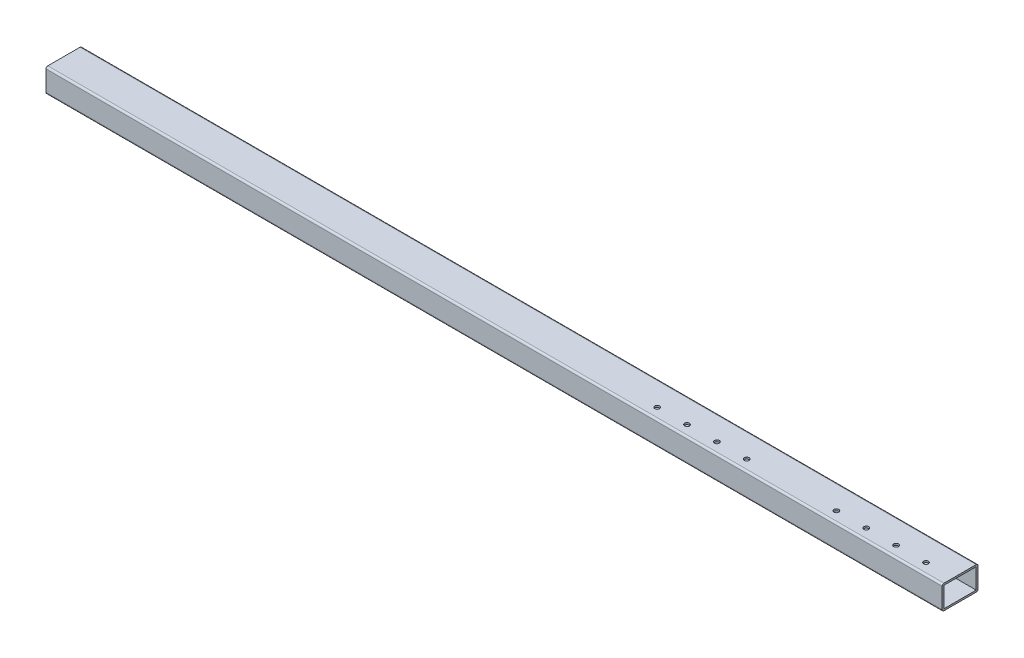
ISO-10303-21;
HEADER;
FILE_DESCRIPTION(('STEP AP214'),'2;1');
FILE_NAME('part.step','',(''),(''),'','','');
FILE_SCHEMA(('AUTOMOTIVE_DESIGN { 1 0 10303 214 1 1 1 1 }'));
ENDSEC;
DATA;
#1=APPLICATION_CONTEXT('core data for automotive mechanical design processes');
#2=APPLICATION_PROTOCOL_DEFINITION('international standard','automotive_design',2000,#1);
#3=PRODUCT_CONTEXT('',#1,'mechanical');
#4=PRODUCT('Part','Part','',(#3));
#5=PRODUCT_RELATED_PRODUCT_CATEGORY('part','',(#4));
#6=PRODUCT_DEFINITION_FORMATION('','',#4);
#7=PRODUCT_DEFINITION_CONTEXT('part definition',#1,'design');
#8=PRODUCT_DEFINITION('design','',#6,#7);
#9=PRODUCT_DEFINITION_SHAPE('','',#8);
#10=(LENGTH_UNIT() NAMED_UNIT(*) SI_UNIT(.MILLI.,.METRE.));
#11=(NAMED_UNIT(*) PLANE_ANGLE_UNIT() SI_UNIT($,.RADIAN.));
#12=(NAMED_UNIT(*) SI_UNIT($,.STERADIAN.) SOLID_ANGLE_UNIT());
#13=UNCERTAINTY_MEASURE_WITH_UNIT(LENGTH_MEASURE(1.E-05),#10,'distance_accuracy_value','');
#14=(GEOMETRIC_REPRESENTATION_CONTEXT(3) GLOBAL_UNCERTAINTY_ASSIGNED_CONTEXT((#13)) GLOBAL_UNIT_ASSIGNED_CONTEXT((#10,
#11,#12)) REPRESENTATION_CONTEXT('',''));
#15=CARTESIAN_POINT('',(0.,0.,0.));
#16=DIRECTION('',(0.,0.,1.));
#17=DIRECTION('',(1.,0.,0.));
#18=AXIS2_PLACEMENT_3D('',#15,#16,#17);
#19=CARTESIAN_POINT('',(1500.,17.,27.));
#20=DIRECTION('',(1.,0.,0.));
#21=DIRECTION('',(0.,0.,-1.));
#22=AXIS2_PLACEMENT_3D('',#19,#20,#21);
#23=PLANE('',#22);
#24=CARTESIAN_POINT('',(1500.,17.,27.));
#25=DIRECTION('',(1.,0.,0.));
#26=DIRECTION('',(0.,0.,-1.));
#27=AXIS2_PLACEMENT_3D('',#24,#25,#26);
#28=CIRCLE('',#27,2.99999999999999);
#29=CARTESIAN_POINT('',(1500.,20.,27.));
#30=VERTEX_POINT('',#29);
#31=CARTESIAN_POINT('',(1500.,17.,30.));
#32=VERTEX_POINT('',#31);
#33=EDGE_CURVE('E199',#30,#32,#28,.T.);
#34=ORIENTED_EDGE('',*,*,#33,.T.);
#35=DIRECTION('',(0.,-1.,0.));
#36=VECTOR('',#35,1.);
#37=CARTESIAN_POINT('',(1500.,17.,30.));
#38=LINE('',#37,#36);
#39=CARTESIAN_POINT('',(1500.,-17.,30.));
#40=VERTEX_POINT('',#39);
#41=EDGE_CURVE('E202',#32,#40,#38,.T.);
#42=ORIENTED_EDGE('',*,*,#41,.T.);
#43=CARTESIAN_POINT('',(1500.,-17.,27.));
#44=DIRECTION('',(1.,0.,0.));
#45=DIRECTION('',(0.,0.,-1.));
#46=AXIS2_PLACEMENT_3D('',#43,#44,#45);
#47=CIRCLE('',#46,3.);
#48=CARTESIAN_POINT('',(1500.,-20.,27.));
#49=VERTEX_POINT('',#48);
#50=EDGE_CURVE('E205',#40,#49,#47,.T.);
#51=ORIENTED_EDGE('',*,*,#50,.T.);
#52=DIRECTION('',(0.,0.,-1.));
#53=VECTOR('',#52,1.);
#54=CARTESIAN_POINT('',(1500.,-20.,27.));
#55=LINE('',#54,#53);
#56=CARTESIAN_POINT('',(1500.,-20.,-27.));
#57=VERTEX_POINT('',#56);
#58=EDGE_CURVE('E207',#49,#57,#55,.T.);
#59=ORIENTED_EDGE('',*,*,#58,.T.);
#60=CARTESIAN_POINT('',(1500.,-17.,-27.));
#61=DIRECTION('',(1.,0.,0.));
#62=DIRECTION('',(0.,0.,-1.));
#63=AXIS2_PLACEMENT_3D('',#60,#61,#62);
#64=CIRCLE('',#63,3.);
#65=CARTESIAN_POINT('',(1500.,-17.,-30.));
#66=VERTEX_POINT('',#65);
#67=EDGE_CURVE('E209',#57,#66,#64,.T.);
#68=ORIENTED_EDGE('',*,*,#67,.T.);
#69=DIRECTION('',(0.,1.,0.));
#70=VECTOR('',#69,1.);
#71=CARTESIAN_POINT('',(1500.,17.,-30.));
#72=LINE('',#71,#70);
#73=CARTESIAN_POINT('',(1500.,17.,-30.));
#74=VERTEX_POINT('',#73);
#75=EDGE_CURVE('E211',#66,#74,#72,.T.);
#76=ORIENTED_EDGE('',*,*,#75,.T.);
#77=CARTESIAN_POINT('',(1500.,17.,-27.));
#78=DIRECTION('',(1.,0.,0.));
#79=DIRECTION('',(0.,0.,1.));
#80=AXIS2_PLACEMENT_3D('',#77,#78,#79);
#81=CIRCLE('',#80,3.);
#82=CARTESIAN_POINT('',(1500.,20.,-27.));
#83=VERTEX_POINT('',#82);
#84=EDGE_CURVE('E213',#74,#83,#81,.T.);
#85=ORIENTED_EDGE('',*,*,#84,.T.);
#86=DIRECTION('',(0.,0.,1.));
#87=VECTOR('',#86,1.);
#88=CARTESIAN_POINT('',(1500.,20.,27.));
#89=LINE('',#88,#87);
#90=EDGE_CURVE('E215',#83,#30,#89,.T.);
#91=ORIENTED_EDGE('',*,*,#90,.T.);
#92=EDGE_LOOP('',(#34,#42,#51,#59,#68,#76,#85,#91));
#93=FACE_BOUND('',#92,.T.);
#94=DIRECTION('',(0.,0.,-1.));
#95=VECTOR('',#94,1.);
#96=CARTESIAN_POINT('',(1500.,-17.,27.));
#97=LINE('',#96,#95);
#98=CARTESIAN_POINT('',(1500.,-17.,27.));
#99=VERTEX_POINT('',#98);
#100=CARTESIAN_POINT('',(1500.,-17.,-27.));
#101=VERTEX_POINT('',#100);
#102=EDGE_CURVE('E169',#99,#101,#97,.T.);
#103=ORIENTED_EDGE('',*,*,#102,.F.);
#104=DIRECTION('',(0.,-1.,0.));
#105=VECTOR('',#104,1.);
#106=CARTESIAN_POINT('',(1500.,17.,27.));
#107=LINE('',#106,#105);
#108=CARTESIAN_POINT('',(1500.,17.,27.));
#109=VERTEX_POINT('',#108);
#110=EDGE_CURVE('E161',#109,#99,#107,.T.);
#111=ORIENTED_EDGE('',*,*,#110,.F.);
#112=DIRECTION('',(0.,0.,1.));
#113=VECTOR('',#112,1.);
#114=CARTESIAN_POINT('',(1500.,17.,27.));
#115=LINE('',#114,#113);
#116=CARTESIAN_POINT('',(1500.,17.,-27.));
#117=VERTEX_POINT('',#116);
#118=EDGE_CURVE('E183',#117,#109,#115,.T.);
#119=ORIENTED_EDGE('',*,*,#118,.F.);
#120=DIRECTION('',(0.,1.,0.));
#121=VECTOR('',#120,1.);
#122=CARTESIAN_POINT('',(1500.,17.,-27.));
#123=LINE('',#122,#121);
#124=EDGE_CURVE('E181',#101,#117,#123,.T.);
#125=ORIENTED_EDGE('',*,*,#124,.F.);
#126=EDGE_LOOP('',(#103,#111,#119,#125));
#127=FACE_BOUND('',#126,.T.);
#128=ADVANCED_FACE('F70',(#93,#127),#23,.T.);
#129=CARTESIAN_POINT('',(0.,17.,27.));
#130=DIRECTION('',(1.,0.,0.));
#131=DIRECTION('',(0.,0.,-1.));
#132=AXIS2_PLACEMENT_3D('',#129,#130,#131);
#133=PLANE('',#132);
#134=CARTESIAN_POINT('',(0.,17.,27.));
#135=DIRECTION('',(1.,0.,0.));
#136=DIRECTION('',(0.,0.,-1.));
#137=AXIS2_PLACEMENT_3D('',#134,#135,#136);
#138=CIRCLE('',#137,2.99999999999999);
#139=CARTESIAN_POINT('',(0.,20.,27.));
#140=VERTEX_POINT('',#139);
#141=CARTESIAN_POINT('',(0.,17.,30.));
#142=VERTEX_POINT('',#141);
#143=EDGE_CURVE('E177',#140,#142,#138,.T.);
#144=ORIENTED_EDGE('',*,*,#143,.F.);
#145=DIRECTION('',(0.,0.,1.));
#146=VECTOR('',#145,1.);
#147=CARTESIAN_POINT('',(0.,20.,27.));
#148=LINE('',#147,#146);
#149=CARTESIAN_POINT('',(0.,20.,-27.));
#150=VERTEX_POINT('',#149);
#151=EDGE_CURVE('E203',#150,#140,#148,.T.);
#152=ORIENTED_EDGE('',*,*,#151,.F.);
#153=CARTESIAN_POINT('',(0.,17.,-27.));
#154=DIRECTION('',(1.,0.,0.));
#155=DIRECTION('',(0.,0.,1.));
#156=AXIS2_PLACEMENT_3D('',#153,#154,#155);
#157=CIRCLE('',#156,3.);
#158=CARTESIAN_POINT('',(0.,17.,-30.));
#159=VERTEX_POINT('',#158);
#160=EDGE_CURVE('E230',#159,#150,#157,.T.);
#161=ORIENTED_EDGE('',*,*,#160,.F.);
#162=DIRECTION('',(0.,1.,0.));
#163=VECTOR('',#162,1.);
#164=CARTESIAN_POINT('',(0.,17.,-30.));
#165=LINE('',#164,#163);
#166=CARTESIAN_POINT('',(0.,-17.,-30.));
#167=VERTEX_POINT('',#166);
#168=EDGE_CURVE('E228',#167,#159,#165,.T.);
#169=ORIENTED_EDGE('',*,*,#168,.F.);
#170=CARTESIAN_POINT('',(0.,-17.,-27.));
#171=DIRECTION('',(1.,0.,0.));
#172=DIRECTION('',(0.,0.,-1.));
#173=AXIS2_PLACEMENT_3D('',#170,#171,#172);
#174=CIRCLE('',#173,3.);
#175=CARTESIAN_POINT('',(0.,-20.,-27.));
#176=VERTEX_POINT('',#175);
#177=EDGE_CURVE('E226',#176,#167,#174,.T.);
#178=ORIENTED_EDGE('',*,*,#177,.F.);
#179=DIRECTION('',(0.,0.,-1.));
#180=VECTOR('',#179,1.);
#181=CARTESIAN_POINT('',(0.,-20.,27.));
#182=LINE('',#181,#180);
#183=CARTESIAN_POINT('',(0.,-20.,27.));
#184=VERTEX_POINT('',#183);
#185=EDGE_CURVE('E224',#184,#176,#182,.T.);
#186=ORIENTED_EDGE('',*,*,#185,.F.);
#187=CARTESIAN_POINT('',(0.,-17.,27.));
#188=DIRECTION('',(1.,0.,0.));
#189=DIRECTION('',(0.,0.,-1.));
#190=AXIS2_PLACEMENT_3D('',#187,#188,#189);
#191=CIRCLE('',#190,3.);
#192=CARTESIAN_POINT('',(0.,-17.,30.));
#193=VERTEX_POINT('',#192);
#194=EDGE_CURVE('E222',#193,#184,#191,.T.);
#195=ORIENTED_EDGE('',*,*,#194,.F.);
#196=DIRECTION('',(0.,-1.,0.));
#197=VECTOR('',#196,1.);
#198=CARTESIAN_POINT('',(0.,17.,30.));
#199=LINE('',#198,#197);
#200=EDGE_CURVE('E220',#142,#193,#199,.T.);
#201=ORIENTED_EDGE('',*,*,#200,.F.);
#202=EDGE_LOOP('',(#144,#152,#161,#169,#178,#186,#195,#201));
#203=FACE_BOUND('',#202,.T.);
#204=DIRECTION('',(0.,-1.,0.));
#205=VECTOR('',#204,1.);
#206=CARTESIAN_POINT('',(0.,17.,27.));
#207=LINE('',#206,#205);
#208=CARTESIAN_POINT('',(0.,17.,27.));
#209=VERTEX_POINT('',#208);
#210=CARTESIAN_POINT('',(0.,-17.,27.));
#211=VERTEX_POINT('',#210);
#212=EDGE_CURVE('E95',#209,#211,#207,.T.);
#213=ORIENTED_EDGE('',*,*,#212,.T.);
#214=DIRECTION('',(0.,0.,-1.));
#215=VECTOR('',#214,1.);
#216=CARTESIAN_POINT('',(0.,-17.,27.));
#217=LINE('',#216,#215);
#218=CARTESIAN_POINT('',(0.,-17.,-27.));
#219=VERTEX_POINT('',#218);
#220=EDGE_CURVE('E176',#211,#219,#217,.T.);
#221=ORIENTED_EDGE('',*,*,#220,.T.);
#222=DIRECTION('',(0.,1.,0.));
#223=VECTOR('',#222,1.);
#224=CARTESIAN_POINT('',(0.,17.,-27.));
#225=LINE('',#224,#223);
#226=CARTESIAN_POINT('',(0.,17.,-27.));
#227=VERTEX_POINT('',#226);
#228=EDGE_CURVE('E191',#219,#227,#225,.T.);
#229=ORIENTED_EDGE('',*,*,#228,.T.);
#230=DIRECTION('',(0.,0.,1.));
#231=VECTOR('',#230,1.);
#232=CARTESIAN_POINT('',(0.,17.,27.));
#233=LINE('',#232,#231);
#234=EDGE_CURVE('E170',#227,#209,#233,.T.);
#235=ORIENTED_EDGE('',*,*,#234,.T.);
#236=EDGE_LOOP('',(#213,#221,#229,#235));
#237=FACE_BOUND('',#236,.T.);
#238=ADVANCED_FACE('F319',(#203,#237),#133,.F.);
#239=CARTESIAN_POINT('',(1500.,17.,27.));
#240=DIRECTION('',(-1.,0.,0.));
#241=DIRECTION('',(0.,0.,1.));
#242=AXIS2_PLACEMENT_3D('',#239,#240,#241);
#243=CYLINDRICAL_SURFACE('',#242,2.99999999999999);
#244=ORIENTED_EDGE('',*,*,#143,.T.);
#245=DIRECTION('',(-1.,0.,0.));
#246=VECTOR('',#245,1.);
#247=CARTESIAN_POINT('',(1500.,17.,30.));
#248=LINE('',#247,#246);
#249=EDGE_CURVE('E12',#32,#142,#248,.T.);
#250=ORIENTED_EDGE('',*,*,#249,.F.);
#251=ORIENTED_EDGE('',*,*,#33,.F.);
#252=DIRECTION('',(-1.,0.,0.));
#253=VECTOR('',#252,1.);
#254=CARTESIAN_POINT('',(1500.,20.,27.));
#255=LINE('',#254,#253);
#256=EDGE_CURVE('E217',#30,#140,#255,.T.);
#257=ORIENTED_EDGE('',*,*,#256,.T.);
#258=EDGE_LOOP('',(#244,#250,#251,#257));
#259=FACE_BOUND('',#258,.T.);
#260=ADVANCED_FACE('F72',(#259),#243,.T.);
#261=CARTESIAN_POINT('',(1500.,17.,30.));
#262=DIRECTION('',(0.,0.,-1.));
#263=DIRECTION('',(0.,1.,0.));
#264=AXIS2_PLACEMENT_3D('',#261,#262,#263);
#265=PLANE('',#264);
#266=ORIENTED_EDGE('',*,*,#200,.T.);
#267=DIRECTION('',(-1.,0.,0.));
#268=VECTOR('',#267,1.);
#269=CARTESIAN_POINT('',(1500.,-17.,30.));
#270=LINE('',#269,#268);
#271=EDGE_CURVE('E79',#40,#193,#270,.T.);
#272=ORIENTED_EDGE('',*,*,#271,.F.);
#273=ORIENTED_EDGE('',*,*,#41,.F.);
#274=ORIENTED_EDGE('',*,*,#249,.T.);
#275=EDGE_LOOP('',(#266,#272,#273,#274));
#276=FACE_BOUND('',#275,.T.);
#277=ADVANCED_FACE('F349',(#276),#265,.F.);
#278=CARTESIAN_POINT('',(1500.,-17.,27.));
#279=DIRECTION('',(-1.,0.,0.));
#280=DIRECTION('',(0.,0.,1.));
#281=AXIS2_PLACEMENT_3D('',#278,#279,#280);
#282=CYLINDRICAL_SURFACE('',#281,3.);
#283=ORIENTED_EDGE('',*,*,#194,.T.);
#284=DIRECTION('',(-1.,0.,0.));
#285=VECTOR('',#284,1.);
#286=CARTESIAN_POINT('',(1500.,-20.,27.));
#287=LINE('',#286,#285);
#288=EDGE_CURVE('E247',#49,#184,#287,.T.);
#289=ORIENTED_EDGE('',*,*,#288,.F.);
#290=ORIENTED_EDGE('',*,*,#50,.F.);
#291=ORIENTED_EDGE('',*,*,#271,.T.);
#292=EDGE_LOOP('',(#283,#289,#290,#291));
#293=FACE_BOUND('',#292,.T.);
#294=ADVANCED_FACE('F346',(#293),#282,.T.);
#295=CARTESIAN_POINT('',(1500.,-20.,27.));
#296=DIRECTION('',(0.,1.,0.));
#297=DIRECTION('',(0.,0.,1.));
#298=AXIS2_PLACEMENT_3D('',#295,#296,#297);
#299=PLANE('',#298);
#300=CARTESIAN_POINT('',(1405.,-20.,12.0000000000003));
#301=DIRECTION('',(0.,1.,0.));
#302=DIRECTION('',(0.,0.,1.));
#303=AXIS2_PLACEMENT_3D('',#300,#301,#302);
#304=CIRCLE('',#303,4.05000000000013);
#305=CARTESIAN_POINT('',(1405.,-20.,16.0500000000005));
#306=VERTEX_POINT('',#305);
#307=EDGE_CURVE('E260',#306,#306,#304,.T.);
#308=ORIENTED_EDGE('',*,*,#307,.T.);
#309=EDGE_LOOP('',(#308));
#310=FACE_BOUND('',#309,.T.);
#311=CARTESIAN_POINT('',(1355.,-20.,12.0000000000007));
#312=DIRECTION('',(0.,1.,0.));
#313=DIRECTION('',(0.,0.,1.));
#314=AXIS2_PLACEMENT_3D('',#311,#312,#313);
#315=CIRCLE('',#314,4.05000000000013);
#316=CARTESIAN_POINT('',(1355.,-20.,16.0500000000008));
#317=VERTEX_POINT('',#316);
#318=EDGE_CURVE('E446',#317,#317,#315,.T.);
#319=ORIENTED_EDGE('',*,*,#318,.T.);
#320=EDGE_LOOP('',(#319));
#321=FACE_BOUND('',#320,.T.);
#322=CARTESIAN_POINT('',(1305.,-20.,12.000000000001));
#323=DIRECTION('',(0.,1.,0.));
#324=DIRECTION('',(0.,0.,1.));
#325=AXIS2_PLACEMENT_3D('',#322,#323,#324);
#326=CIRCLE('',#325,4.05000000000013);
#327=CARTESIAN_POINT('',(1305.,-20.,16.0500000000012));
#328=VERTEX_POINT('',#327);
#329=EDGE_CURVE('E454',#328,#328,#326,.T.);
#330=ORIENTED_EDGE('',*,*,#329,.T.);
#331=EDGE_LOOP('',(#330));
#332=FACE_BOUND('',#331,.T.);
#333=CARTESIAN_POINT('',(1155.,-20.,12.0000000000021));
#334=DIRECTION('',(0.,1.,0.));
#335=DIRECTION('',(0.,0.,1.));
#336=AXIS2_PLACEMENT_3D('',#333,#334,#335);
#337=CIRCLE('',#336,4.05000000000013);
#338=CARTESIAN_POINT('',(1155.,-20.,16.0500000000022));
#339=VERTEX_POINT('',#338);
#340=EDGE_CURVE('E460',#339,#339,#337,.T.);
#341=ORIENTED_EDGE('',*,*,#340,.T.);
#342=EDGE_LOOP('',(#341));
#343=FACE_BOUND('',#342,.T.);
#344=CARTESIAN_POINT('',(1105.,-20.,12.0000000000024));
#345=DIRECTION('',(0.,1.,0.));
#346=DIRECTION('',(0.,0.,1.));
#347=AXIS2_PLACEMENT_3D('',#344,#345,#346);
#348=CIRCLE('',#347,4.05000000000013);
#349=CARTESIAN_POINT('',(1105.,-20.,16.0500000000026));
#350=VERTEX_POINT('',#349);
#351=EDGE_CURVE('E466',#350,#350,#348,.T.);
#352=ORIENTED_EDGE('',*,*,#351,.T.);
#353=EDGE_LOOP('',(#352));
#354=FACE_BOUND('',#353,.T.);
#355=CARTESIAN_POINT('',(1055.,-20.,12.0000000000028));
#356=DIRECTION('',(0.,1.,0.));
#357=DIRECTION('',(0.,0.,1.));
#358=AXIS2_PLACEMENT_3D('',#355,#356,#357);
#359=CIRCLE('',#358,4.05000000000013);
#360=CARTESIAN_POINT('',(1055.,-20.,16.0500000000029));
#361=VERTEX_POINT('',#360);
#362=EDGE_CURVE('E472',#361,#361,#359,.T.);
#363=ORIENTED_EDGE('',*,*,#362,.T.);
#364=EDGE_LOOP('',(#363));
#365=FACE_BOUND('',#364,.T.);
#366=CARTESIAN_POINT('',(1005.,-20.,12.0000000000031));
#367=DIRECTION('',(0.,1.,0.));
#368=DIRECTION('',(0.,0.,1.));
#369=AXIS2_PLACEMENT_3D('',#366,#367,#368);
#370=CIRCLE('',#369,4.05000000000013);
#371=CARTESIAN_POINT('',(1005.,-20.,16.0500000000033));
#372=VERTEX_POINT('',#371);
#373=EDGE_CURVE('E478',#372,#372,#370,.T.);
#374=ORIENTED_EDGE('',*,*,#373,.T.);
#375=EDGE_LOOP('',(#374));
#376=FACE_BOUND('',#375,.T.);
#377=CARTESIAN_POINT('',(1455.,-20.,12.));
#378=DIRECTION('',(0.,1.,0.));
#379=DIRECTION('',(0.,0.,1.));
#380=AXIS2_PLACEMENT_3D('',#377,#378,#379);
#381=CIRCLE('',#380,4.05000000000013);
#382=CARTESIAN_POINT('',(1455.,-20.,16.0500000000001));
#383=VERTEX_POINT('',#382);
#384=EDGE_CURVE('E255',#383,#383,#381,.T.);
#385=ORIENTED_EDGE('',*,*,#384,.T.);
#386=EDGE_LOOP('',(#385));
#387=FACE_BOUND('',#386,.T.);
#388=ORIENTED_EDGE('',*,*,#185,.T.);
#389=DIRECTION('',(-1.,0.,0.));
#390=VECTOR('',#389,1.);
#391=CARTESIAN_POINT('',(1500.,-20.,-27.));
#392=LINE('',#391,#390);
#393=EDGE_CURVE('E244',#57,#176,#392,.T.);
#394=ORIENTED_EDGE('',*,*,#393,.F.);
#395=ORIENTED_EDGE('',*,*,#58,.F.);
#396=ORIENTED_EDGE('',*,*,#288,.T.);
#397=EDGE_LOOP('',(#388,#394,#395,#396));
#398=FACE_BOUND('',#397,.T.);
#399=ADVANCED_FACE('F342',(#310,#321,#332,#343,#354,#365,#376,#387,#398),#299,.F.);
#400=CARTESIAN_POINT('',(1500.,-17.,-27.));
#401=DIRECTION('',(-1.,0.,0.));
#402=DIRECTION('',(0.,0.,1.));
#403=AXIS2_PLACEMENT_3D('',#400,#401,#402);
#404=CYLINDRICAL_SURFACE('',#403,3.);
#405=ORIENTED_EDGE('',*,*,#177,.T.);
#406=DIRECTION('',(-1.,0.,0.));
#407=VECTOR('',#406,1.);
#408=CARTESIAN_POINT('',(1500.,-17.,-30.));
#409=LINE('',#408,#407);
#410=EDGE_CURVE('E241',#66,#167,#409,.T.);
#411=ORIENTED_EDGE('',*,*,#410,.F.);
#412=ORIENTED_EDGE('',*,*,#67,.F.);
#413=ORIENTED_EDGE('',*,*,#393,.T.);
#414=EDGE_LOOP('',(#405,#411,#412,#413));
#415=FACE_BOUND('',#414,.T.);
#416=ADVANCED_FACE('F338',(#415),#404,.T.);
#417=CARTESIAN_POINT('',(1500.,17.,-30.));
#418=DIRECTION('',(0.,0.,1.));
#419=DIRECTION('',(0.,-1.,0.));
#420=AXIS2_PLACEMENT_3D('',#417,#418,#419);
#421=PLANE('',#420);
#422=ORIENTED_EDGE('',*,*,#168,.T.);
#423=DIRECTION('',(-1.,0.,0.));
#424=VECTOR('',#423,1.);
#425=CARTESIAN_POINT('',(1500.,17.,-30.));
#426=LINE('',#425,#424);
#427=EDGE_CURVE('E238',#74,#159,#426,.T.);
#428=ORIENTED_EDGE('',*,*,#427,.F.);
#429=ORIENTED_EDGE('',*,*,#75,.F.);
#430=ORIENTED_EDGE('',*,*,#410,.T.);
#431=EDGE_LOOP('',(#422,#428,#429,#430));
#432=FACE_BOUND('',#431,.T.);
#433=ADVANCED_FACE('F334',(#432),#421,.F.);
#434=CARTESIAN_POINT('',(1500.,17.,-27.));
#435=DIRECTION('',(-1.,0.,0.));
#436=DIRECTION('',(0.,0.,1.));
#437=AXIS2_PLACEMENT_3D('',#434,#435,#436);
#438=CYLINDRICAL_SURFACE('',#437,3.);
#439=ORIENTED_EDGE('',*,*,#160,.T.);
#440=DIRECTION('',(-1.,0.,0.));
#441=VECTOR('',#440,1.);
#442=CARTESIAN_POINT('',(1500.,20.,-27.));
#443=LINE('',#442,#441);
#444=EDGE_CURVE('E235',#83,#150,#443,.T.);
#445=ORIENTED_EDGE('',*,*,#444,.F.);
#446=ORIENTED_EDGE('',*,*,#84,.F.);
#447=ORIENTED_EDGE('',*,*,#427,.T.);
#448=EDGE_LOOP('',(#439,#445,#446,#447));
#449=FACE_BOUND('',#448,.T.);
#450=ADVANCED_FACE('F330',(#449),#438,.T.);
#451=CARTESIAN_POINT('',(1500.,20.,27.));
#452=DIRECTION('',(0.,-1.,0.));
#453=DIRECTION('',(0.,0.,-1.));
#454=AXIS2_PLACEMENT_3D('',#451,#452,#453);
#455=PLANE('',#454);
#456=CARTESIAN_POINT('',(1405.,20.,12.0000000000003));
#457=DIRECTION('',(0.,1.,0.));
#458=DIRECTION('',(0.,0.,1.));
#459=AXIS2_PLACEMENT_3D('',#456,#457,#458);
#460=CIRCLE('',#459,4.05000000000013);
#461=CARTESIAN_POINT('',(1405.,20.,16.0500000000005));
#462=VERTEX_POINT('',#461);
#463=EDGE_CURVE('E443',#462,#462,#460,.T.);
#464=ORIENTED_EDGE('',*,*,#463,.F.);
#465=EDGE_LOOP('',(#464));
#466=FACE_BOUND('',#465,.T.);
#467=CARTESIAN_POINT('',(1355.,20.,12.0000000000007));
#468=DIRECTION('',(0.,1.,0.));
#469=DIRECTION('',(0.,0.,1.));
#470=AXIS2_PLACEMENT_3D('',#467,#468,#469);
#471=CIRCLE('',#470,4.05000000000013);
#472=CARTESIAN_POINT('',(1355.,20.,16.0500000000008));
#473=VERTEX_POINT('',#472);
#474=EDGE_CURVE('E451',#473,#473,#471,.T.);
#475=ORIENTED_EDGE('',*,*,#474,.F.);
#476=EDGE_LOOP('',(#475));
#477=FACE_BOUND('',#476,.T.);
#478=CARTESIAN_POINT('',(1305.,20.,12.000000000001));
#479=DIRECTION('',(0.,1.,0.));
#480=DIRECTION('',(0.,0.,1.));
#481=AXIS2_PLACEMENT_3D('',#478,#479,#480);
#482=CIRCLE('',#481,4.05000000000013);
#483=CARTESIAN_POINT('',(1305.,20.,16.0500000000012));
#484=VERTEX_POINT('',#483);
#485=EDGE_CURVE('E457',#484,#484,#482,.T.);
#486=ORIENTED_EDGE('',*,*,#485,.F.);
#487=EDGE_LOOP('',(#486));
#488=FACE_BOUND('',#487,.T.);
#489=CARTESIAN_POINT('',(1155.,20.,12.0000000000021));
#490=DIRECTION('',(0.,1.,0.));
#491=DIRECTION('',(0.,0.,1.));
#492=AXIS2_PLACEMENT_3D('',#489,#490,#491);
#493=CIRCLE('',#492,4.05000000000013);
#494=CARTESIAN_POINT('',(1155.,20.,16.0500000000022));
#495=VERTEX_POINT('',#494);
#496=EDGE_CURVE('E463',#495,#495,#493,.T.);
#497=ORIENTED_EDGE('',*,*,#496,.F.);
#498=EDGE_LOOP('',(#497));
#499=FACE_BOUND('',#498,.T.);
#500=CARTESIAN_POINT('',(1105.,20.,12.0000000000024));
#501=DIRECTION('',(0.,1.,0.));
#502=DIRECTION('',(0.,0.,1.));
#503=AXIS2_PLACEMENT_3D('',#500,#501,#502);
#504=CIRCLE('',#503,4.05000000000013);
#505=CARTESIAN_POINT('',(1105.,20.,16.0500000000026));
#506=VERTEX_POINT('',#505);
#507=EDGE_CURVE('E469',#506,#506,#504,.T.);
#508=ORIENTED_EDGE('',*,*,#507,.F.);
#509=EDGE_LOOP('',(#508));
#510=FACE_BOUND('',#509,.T.);
#511=CARTESIAN_POINT('',(1055.,20.,12.0000000000028));
#512=DIRECTION('',(0.,1.,0.));
#513=DIRECTION('',(0.,0.,1.));
#514=AXIS2_PLACEMENT_3D('',#511,#512,#513);
#515=CIRCLE('',#514,4.05000000000013);
#516=CARTESIAN_POINT('',(1055.,20.,16.0500000000029));
#517=VERTEX_POINT('',#516);
#518=EDGE_CURVE('E475',#517,#517,#515,.T.);
#519=ORIENTED_EDGE('',*,*,#518,.F.);
#520=EDGE_LOOP('',(#519));
#521=FACE_BOUND('',#520,.T.);
#522=CARTESIAN_POINT('',(1005.,20.,12.0000000000031));
#523=DIRECTION('',(0.,1.,0.));
#524=DIRECTION('',(0.,0.,1.));
#525=AXIS2_PLACEMENT_3D('',#522,#523,#524);
#526=CIRCLE('',#525,4.05000000000013);
#527=CARTESIAN_POINT('',(1005.,20.,16.0500000000033));
#528=VERTEX_POINT('',#527);
#529=EDGE_CURVE('E481',#528,#528,#526,.T.);
#530=ORIENTED_EDGE('',*,*,#529,.F.);
#531=EDGE_LOOP('',(#530));
#532=FACE_BOUND('',#531,.T.);
#533=CARTESIAN_POINT('',(1455.,20.,12.));
#534=DIRECTION('',(0.,1.,0.));
#535=DIRECTION('',(0.,0.,1.));
#536=AXIS2_PLACEMENT_3D('',#533,#534,#535);
#537=CIRCLE('',#536,4.05000000000013);
#538=CARTESIAN_POINT('',(1455.,20.,16.0500000000001));
#539=VERTEX_POINT('',#538);
#540=EDGE_CURVE('E293',#539,#539,#537,.T.);
#541=ORIENTED_EDGE('',*,*,#540,.F.);
#542=EDGE_LOOP('',(#541));
#543=FACE_BOUND('',#542,.T.);
#544=ORIENTED_EDGE('',*,*,#151,.T.);
#545=ORIENTED_EDGE('',*,*,#256,.F.);
#546=ORIENTED_EDGE('',*,*,#90,.F.);
#547=ORIENTED_EDGE('',*,*,#444,.T.);
#548=EDGE_LOOP('',(#544,#545,#546,#547));
#549=FACE_BOUND('',#548,.T.);
#550=ADVANCED_FACE('F314',(#466,#477,#488,#499,#510,#521,#532,#543,#549),#455,.F.);
#551=CARTESIAN_POINT('',(1500.,17.,27.));
#552=DIRECTION('',(0.,0.,-1.));
#553=DIRECTION('',(0.,1.,0.));
#554=AXIS2_PLACEMENT_3D('',#551,#552,#553);
#555=PLANE('',#554);
#556=ORIENTED_EDGE('',*,*,#212,.F.);
#557=DIRECTION('',(-1.,0.,0.));
#558=VECTOR('',#557,1.);
#559=CARTESIAN_POINT('',(1500.,17.,27.));
#560=LINE('',#559,#558);
#561=EDGE_CURVE('E165',#109,#209,#560,.T.);
#562=ORIENTED_EDGE('',*,*,#561,.F.);
#563=ORIENTED_EDGE('',*,*,#110,.T.);
#564=DIRECTION('',(-1.,0.,0.));
#565=VECTOR('',#564,1.);
#566=CARTESIAN_POINT('',(1500.,-17.,27.));
#567=LINE('',#566,#565);
#568=EDGE_CURVE('E164',#99,#211,#567,.T.);
#569=ORIENTED_EDGE('',*,*,#568,.T.);
#570=EDGE_LOOP('',(#556,#562,#563,#569));
#571=FACE_BOUND('',#570,.T.);
#572=ADVANCED_FACE('F163',(#571),#555,.T.);
#573=CARTESIAN_POINT('',(1500.,-17.,27.));
#574=DIRECTION('',(0.,1.,0.));
#575=DIRECTION('',(0.,0.,1.));
#576=AXIS2_PLACEMENT_3D('',#573,#574,#575);
#577=PLANE('',#576);
#578=CARTESIAN_POINT('',(1405.,-17.,12.0000000000003));
#579=DIRECTION('',(0.,1.,0.));
#580=DIRECTION('',(0.,0.,1.));
#581=AXIS2_PLACEMENT_3D('',#578,#579,#580);
#582=CIRCLE('',#581,4.05000000000013);
#583=CARTESIAN_POINT('',(1405.,-17.,16.0500000000005));
#584=VERTEX_POINT('',#583);
#585=EDGE_CURVE('E290',#584,#584,#582,.T.);
#586=ORIENTED_EDGE('',*,*,#585,.F.);
#587=EDGE_LOOP('',(#586));
#588=FACE_BOUND('',#587,.T.);
#589=CARTESIAN_POINT('',(1355.,-17.,12.0000000000007));
#590=DIRECTION('',(0.,1.,0.));
#591=DIRECTION('',(0.,0.,1.));
#592=AXIS2_PLACEMENT_3D('',#589,#590,#591);
#593=CIRCLE('',#592,4.05000000000013);
#594=CARTESIAN_POINT('',(1355.,-17.,16.0500000000008));
#595=VERTEX_POINT('',#594);
#596=EDGE_CURVE('E278',#595,#595,#593,.T.);
#597=ORIENTED_EDGE('',*,*,#596,.F.);
#598=EDGE_LOOP('',(#597));
#599=FACE_BOUND('',#598,.T.);
#600=CARTESIAN_POINT('',(1305.,-17.,12.000000000001));
#601=DIRECTION('',(0.,1.,0.));
#602=DIRECTION('',(0.,0.,1.));
#603=AXIS2_PLACEMENT_3D('',#600,#601,#602);
#604=CIRCLE('',#603,4.05000000000013);
#605=CARTESIAN_POINT('',(1305.,-17.,16.0500000000012));
#606=VERTEX_POINT('',#605);
#607=EDGE_CURVE('E275',#606,#606,#604,.T.);
#608=ORIENTED_EDGE('',*,*,#607,.F.);
#609=EDGE_LOOP('',(#608));
#610=FACE_BOUND('',#609,.T.);
#611=CARTESIAN_POINT('',(1155.,-17.,12.0000000000021));
#612=DIRECTION('',(0.,1.,0.));
#613=DIRECTION('',(0.,0.,1.));
#614=AXIS2_PLACEMENT_3D('',#611,#612,#613);
#615=CIRCLE('',#614,4.05000000000013);
#616=CARTESIAN_POINT('',(1155.,-17.,16.0500000000022));
#617=VERTEX_POINT('',#616);
#618=EDGE_CURVE('E272',#617,#617,#615,.T.);
#619=ORIENTED_EDGE('',*,*,#618,.F.);
#620=EDGE_LOOP('',(#619));
#621=FACE_BOUND('',#620,.T.);
#622=CARTESIAN_POINT('',(1105.,-17.,12.0000000000024));
#623=DIRECTION('',(0.,1.,0.));
#624=DIRECTION('',(0.,0.,1.));
#625=AXIS2_PLACEMENT_3D('',#622,#623,#624);
#626=CIRCLE('',#625,4.05000000000013);
#627=CARTESIAN_POINT('',(1105.,-17.,16.0500000000026));
#628=VERTEX_POINT('',#627);
#629=EDGE_CURVE('E268',#628,#628,#626,.T.);
#630=ORIENTED_EDGE('',*,*,#629,.F.);
#631=EDGE_LOOP('',(#630));
#632=FACE_BOUND('',#631,.T.);
#633=CARTESIAN_POINT('',(1055.,-17.,12.0000000000028));
#634=DIRECTION('',(0.,1.,0.));
#635=DIRECTION('',(0.,0.,1.));
#636=AXIS2_PLACEMENT_3D('',#633,#634,#635);
#637=CIRCLE('',#636,4.05000000000013);
#638=CARTESIAN_POINT('',(1055.,-17.,16.0500000000029));
#639=VERTEX_POINT('',#638);
#640=EDGE_CURVE('E264',#639,#639,#637,.T.);
#641=ORIENTED_EDGE('',*,*,#640,.F.);
#642=EDGE_LOOP('',(#641));
#643=FACE_BOUND('',#642,.T.);
#644=CARTESIAN_POINT('',(1005.,-17.,12.0000000000031));
#645=DIRECTION('',(0.,1.,0.));
#646=DIRECTION('',(0.,0.,1.));
#647=AXIS2_PLACEMENT_3D('',#644,#645,#646);
#648=CIRCLE('',#647,4.05000000000013);
#649=CARTESIAN_POINT('',(1005.,-17.,16.0500000000033));
#650=VERTEX_POINT('',#649);
#651=EDGE_CURVE('E259',#650,#650,#648,.T.);
#652=ORIENTED_EDGE('',*,*,#651,.F.);
#653=EDGE_LOOP('',(#652));
#654=FACE_BOUND('',#653,.T.);
#655=CARTESIAN_POINT('',(1455.,-17.,12.));
#656=DIRECTION('',(0.,1.,0.));
#657=DIRECTION('',(0.,0.,1.));
#658=AXIS2_PLACEMENT_3D('',#655,#656,#657);
#659=CIRCLE('',#658,4.05000000000013);
#660=CARTESIAN_POINT('',(1455.,-17.,16.0500000000001));
#661=VERTEX_POINT('',#660);
#662=EDGE_CURVE('E189',#661,#661,#659,.T.);
#663=ORIENTED_EDGE('',*,*,#662,.F.);
#664=EDGE_LOOP('',(#663));
#665=FACE_BOUND('',#664,.T.);
#666=ORIENTED_EDGE('',*,*,#220,.F.);
#667=ORIENTED_EDGE('',*,*,#568,.F.);
#668=ORIENTED_EDGE('',*,*,#102,.T.);
#669=DIRECTION('',(-1.,0.,0.));
#670=VECTOR('',#669,1.);
#671=CARTESIAN_POINT('',(1500.,-17.,-27.));
#672=LINE('',#671,#670);
#673=EDGE_CURVE('E178',#101,#219,#672,.T.);
#674=ORIENTED_EDGE('',*,*,#673,.T.);
#675=EDGE_LOOP('',(#666,#667,#668,#674));
#676=FACE_BOUND('',#675,.T.);
#677=ADVANCED_FACE('F173',(#588,#599,#610,#621,#632,#643,#654,#665,#676),#577,.T.);
#678=CARTESIAN_POINT('',(1500.,17.,-27.));
#679=DIRECTION('',(0.,0.,1.));
#680=DIRECTION('',(0.,-1.,0.));
#681=AXIS2_PLACEMENT_3D('',#678,#679,#680);
#682=PLANE('',#681);
#683=ORIENTED_EDGE('',*,*,#228,.F.);
#684=ORIENTED_EDGE('',*,*,#673,.F.);
#685=ORIENTED_EDGE('',*,*,#124,.T.);
#686=DIRECTION('',(-1.,0.,0.));
#687=VECTOR('',#686,1.);
#688=CARTESIAN_POINT('',(1500.,17.,-27.));
#689=LINE('',#688,#687);
#690=EDGE_CURVE('E87',#117,#227,#689,.T.);
#691=ORIENTED_EDGE('',*,*,#690,.T.);
#692=EDGE_LOOP('',(#683,#684,#685,#691));
#693=FACE_BOUND('',#692,.T.);
#694=ADVANCED_FACE('F304',(#693),#682,.T.);
#695=CARTESIAN_POINT('',(1500.,17.,27.));
#696=DIRECTION('',(0.,-1.,0.));
#697=DIRECTION('',(0.,0.,-1.));
#698=AXIS2_PLACEMENT_3D('',#695,#696,#697);
#699=PLANE('',#698);
#700=CARTESIAN_POINT('',(1405.,17.,12.0000000000003));
#701=DIRECTION('',(0.,-1.,0.));
#702=DIRECTION('',(0.,0.,-1.));
#703=AXIS2_PLACEMENT_3D('',#700,#701,#702);
#704=CIRCLE('',#703,4.05000000000013);
#705=CARTESIAN_POINT('',(1405.,17.,7.95000000000022));
#706=VERTEX_POINT('',#705);
#707=EDGE_CURVE('E74',#706,#706,#704,.T.);
#708=ORIENTED_EDGE('',*,*,#707,.F.);
#709=EDGE_LOOP('',(#708));
#710=FACE_BOUND('',#709,.T.);
#711=CARTESIAN_POINT('',(1355.,17.,12.0000000000007));
#712=DIRECTION('',(0.,-1.,0.));
#713=DIRECTION('',(0.,0.,-1.));
#714=AXIS2_PLACEMENT_3D('',#711,#712,#713);
#715=CIRCLE('',#714,4.05000000000013);
#716=CARTESIAN_POINT('',(1355.,17.,7.95000000000057));
#717=VERTEX_POINT('',#716);
#718=EDGE_CURVE('E276',#717,#717,#715,.T.);
#719=ORIENTED_EDGE('',*,*,#718,.F.);
#720=EDGE_LOOP('',(#719));
#721=FACE_BOUND('',#720,.T.);
#722=CARTESIAN_POINT('',(1305.,17.,12.000000000001));
#723=DIRECTION('',(0.,-1.,0.));
#724=DIRECTION('',(0.,0.,-1.));
#725=AXIS2_PLACEMENT_3D('',#722,#723,#724);
#726=CIRCLE('',#725,4.05000000000013);
#727=CARTESIAN_POINT('',(1305.,17.,7.95000000000092));
#728=VERTEX_POINT('',#727);
#729=EDGE_CURVE('E273',#728,#728,#726,.T.);
#730=ORIENTED_EDGE('',*,*,#729,.F.);
#731=EDGE_LOOP('',(#730));
#732=FACE_BOUND('',#731,.T.);
#733=CARTESIAN_POINT('',(1155.,17.,12.0000000000021));
#734=DIRECTION('',(0.,-1.,0.));
#735=DIRECTION('',(0.,0.,-1.));
#736=AXIS2_PLACEMENT_3D('',#733,#734,#735);
#737=CIRCLE('',#736,4.05000000000013);
#738=CARTESIAN_POINT('',(1155.,17.,7.95000000000197));
#739=VERTEX_POINT('',#738);
#740=EDGE_CURVE('E269',#739,#739,#737,.T.);
#741=ORIENTED_EDGE('',*,*,#740,.F.);
#742=EDGE_LOOP('',(#741));
#743=FACE_BOUND('',#742,.T.);
#744=CARTESIAN_POINT('',(1105.,17.,12.0000000000024));
#745=DIRECTION('',(0.,-1.,0.));
#746=DIRECTION('',(0.,0.,-1.));
#747=AXIS2_PLACEMENT_3D('',#744,#745,#746);
#748=CIRCLE('',#747,4.05000000000013);
#749=CARTESIAN_POINT('',(1105.,17.,7.95000000000231));
#750=VERTEX_POINT('',#749);
#751=EDGE_CURVE('E265',#750,#750,#748,.T.);
#752=ORIENTED_EDGE('',*,*,#751,.F.);
#753=EDGE_LOOP('',(#752));
#754=FACE_BOUND('',#753,.T.);
#755=CARTESIAN_POINT('',(1055.,17.,12.0000000000028));
#756=DIRECTION('',(0.,-1.,0.));
#757=DIRECTION('',(0.,0.,-1.));
#758=AXIS2_PLACEMENT_3D('',#755,#756,#757);
#759=CIRCLE('',#758,4.05000000000013);
#760=CARTESIAN_POINT('',(1055.,17.,7.95000000000266));
#761=VERTEX_POINT('',#760);
#762=EDGE_CURVE('E261',#761,#761,#759,.T.);
#763=ORIENTED_EDGE('',*,*,#762,.F.);
#764=EDGE_LOOP('',(#763));
#765=FACE_BOUND('',#764,.T.);
#766=CARTESIAN_POINT('',(1005.,17.,12.0000000000031));
#767=DIRECTION('',(0.,-1.,0.));
#768=DIRECTION('',(0.,0.,-1.));
#769=AXIS2_PLACEMENT_3D('',#766,#767,#768);
#770=CIRCLE('',#769,4.05000000000013);
#771=CARTESIAN_POINT('',(1005.,17.,7.95000000000301));
#772=VERTEX_POINT('',#771);
#773=EDGE_CURVE('E256',#772,#772,#770,.T.);
#774=ORIENTED_EDGE('',*,*,#773,.F.);
#775=EDGE_LOOP('',(#774));
#776=FACE_BOUND('',#775,.T.);
#777=CARTESIAN_POINT('',(1455.,17.,12.));
#778=DIRECTION('',(0.,-1.,0.));
#779=DIRECTION('',(0.,0.,-1.));
#780=AXIS2_PLACEMENT_3D('',#777,#778,#779);
#781=CIRCLE('',#780,4.05000000000013);
#782=CARTESIAN_POINT('',(1455.,17.,7.94999999999987));
#783=VERTEX_POINT('',#782);
#784=EDGE_CURVE('E252',#783,#783,#781,.T.);
#785=ORIENTED_EDGE('',*,*,#784,.F.);
#786=EDGE_LOOP('',(#785));
#787=FACE_BOUND('',#786,.T.);
#788=ORIENTED_EDGE('',*,*,#234,.F.);
#789=ORIENTED_EDGE('',*,*,#690,.F.);
#790=ORIENTED_EDGE('',*,*,#118,.T.);
#791=ORIENTED_EDGE('',*,*,#561,.T.);
#792=EDGE_LOOP('',(#788,#789,#790,#791));
#793=FACE_BOUND('',#792,.T.);
#794=ADVANCED_FACE('F311',(#710,#721,#732,#743,#754,#765,#776,#787,#793),#699,.T.);
#795=CARTESIAN_POINT('',(1455.,-20.,12.));
#796=DIRECTION('',(0.,1.,0.));
#797=DIRECTION('',(0.,0.,1.));
#798=AXIS2_PLACEMENT_3D('',#795,#796,#797);
#799=CYLINDRICAL_SURFACE('',#798,4.05000000000013);
#800=ORIENTED_EDGE('',*,*,#784,.T.);
#801=EDGE_LOOP('',(#800));
#802=FACE_BOUND('',#801,.T.);
#803=ORIENTED_EDGE('',*,*,#540,.T.);
#804=EDGE_LOOP('',(#803));
#805=FACE_BOUND('',#804,.T.);
#806=ADVANCED_FACE('F384',(#802,#805),#799,.F.);
#807=ORIENTED_EDGE('',*,*,#662,.T.);
#808=EDGE_LOOP('',(#807));
#809=FACE_BOUND('',#808,.T.);
#810=ORIENTED_EDGE('',*,*,#384,.F.);
#811=EDGE_LOOP('',(#810));
#812=FACE_BOUND('',#811,.T.);
#813=ADVANCED_FACE('F300',(#809,#812),#799,.F.);
#814=CARTESIAN_POINT('',(1005.,-20.,12.0000000000031));
#815=DIRECTION('',(0.,1.,0.));
#816=DIRECTION('',(0.,0.,1.));
#817=AXIS2_PLACEMENT_3D('',#814,#815,#816);
#818=CYLINDRICAL_SURFACE('',#817,4.05000000000013);
#819=ORIENTED_EDGE('',*,*,#773,.T.);
#820=EDGE_LOOP('',(#819));
#821=FACE_BOUND('',#820,.T.);
#822=ORIENTED_EDGE('',*,*,#529,.T.);
#823=EDGE_LOOP('',(#822));
#824=FACE_BOUND('',#823,.T.);
#825=ADVANCED_FACE('F395',(#821,#824),#818,.F.);
#826=CARTESIAN_POINT('',(1055.,-20.,12.0000000000028));
#827=DIRECTION('',(0.,1.,0.));
#828=DIRECTION('',(0.,0.,1.));
#829=AXIS2_PLACEMENT_3D('',#826,#827,#828);
#830=CYLINDRICAL_SURFACE('',#829,4.05000000000013);
#831=ORIENTED_EDGE('',*,*,#762,.T.);
#832=EDGE_LOOP('',(#831));
#833=FACE_BOUND('',#832,.T.);
#834=ORIENTED_EDGE('',*,*,#518,.T.);
#835=EDGE_LOOP('',(#834));
#836=FACE_BOUND('',#835,.T.);
#837=ADVANCED_FACE('F398',(#833,#836),#830,.F.);
#838=CARTESIAN_POINT('',(1105.,-20.,12.0000000000024));
#839=DIRECTION('',(0.,1.,0.));
#840=DIRECTION('',(0.,0.,1.));
#841=AXIS2_PLACEMENT_3D('',#838,#839,#840);
#842=CYLINDRICAL_SURFACE('',#841,4.05000000000013);
#843=ORIENTED_EDGE('',*,*,#751,.T.);
#844=EDGE_LOOP('',(#843));
#845=FACE_BOUND('',#844,.T.);
#846=ORIENTED_EDGE('',*,*,#507,.T.);
#847=EDGE_LOOP('',(#846));
#848=FACE_BOUND('',#847,.T.);
#849=ADVANCED_FACE('F403',(#845,#848),#842,.F.);
#850=CARTESIAN_POINT('',(1155.,-20.,12.0000000000021));
#851=DIRECTION('',(0.,1.,0.));
#852=DIRECTION('',(0.,0.,1.));
#853=AXIS2_PLACEMENT_3D('',#850,#851,#852);
#854=CYLINDRICAL_SURFACE('',#853,4.05000000000013);
#855=ORIENTED_EDGE('',*,*,#740,.T.);
#856=EDGE_LOOP('',(#855));
#857=FACE_BOUND('',#856,.T.);
#858=ORIENTED_EDGE('',*,*,#496,.T.);
#859=EDGE_LOOP('',(#858));
#860=FACE_BOUND('',#859,.T.);
#861=ADVANCED_FACE('F408',(#857,#860),#854,.F.);
#862=CARTESIAN_POINT('',(1305.,-20.,12.000000000001));
#863=DIRECTION('',(0.,1.,0.));
#864=DIRECTION('',(0.,0.,1.));
#865=AXIS2_PLACEMENT_3D('',#862,#863,#864);
#866=CYLINDRICAL_SURFACE('',#865,4.05000000000013);
#867=ORIENTED_EDGE('',*,*,#729,.T.);
#868=EDGE_LOOP('',(#867));
#869=FACE_BOUND('',#868,.T.);
#870=ORIENTED_EDGE('',*,*,#485,.T.);
#871=EDGE_LOOP('',(#870));
#872=FACE_BOUND('',#871,.T.);
#873=ADVANCED_FACE('F413',(#869,#872),#866,.F.);
#874=CARTESIAN_POINT('',(1355.,-20.,12.0000000000007));
#875=DIRECTION('',(0.,1.,0.));
#876=DIRECTION('',(0.,0.,1.));
#877=AXIS2_PLACEMENT_3D('',#874,#875,#876);
#878=CYLINDRICAL_SURFACE('',#877,4.05000000000013);
#879=ORIENTED_EDGE('',*,*,#718,.T.);
#880=EDGE_LOOP('',(#879));
#881=FACE_BOUND('',#880,.T.);
#882=ORIENTED_EDGE('',*,*,#474,.T.);
#883=EDGE_LOOP('',(#882));
#884=FACE_BOUND('',#883,.T.);
#885=ADVANCED_FACE('F418',(#881,#884),#878,.F.);
#886=CARTESIAN_POINT('',(1405.,-20.,12.0000000000003));
#887=DIRECTION('',(0.,1.,0.));
#888=DIRECTION('',(0.,0.,1.));
#889=AXIS2_PLACEMENT_3D('',#886,#887,#888);
#890=CYLINDRICAL_SURFACE('',#889,4.05000000000013);
#891=ORIENTED_EDGE('',*,*,#707,.T.);
#892=EDGE_LOOP('',(#891));
#893=FACE_BOUND('',#892,.T.);
#894=ORIENTED_EDGE('',*,*,#463,.T.);
#895=EDGE_LOOP('',(#894));
#896=FACE_BOUND('',#895,.T.);
#897=ADVANCED_FACE('F423',(#893,#896),#890,.F.);
#898=ORIENTED_EDGE('',*,*,#651,.T.);
#899=EDGE_LOOP('',(#898));
#900=FACE_BOUND('',#899,.T.);
#901=ORIENTED_EDGE('',*,*,#373,.F.);
#902=EDGE_LOOP('',(#901));
#903=FACE_BOUND('',#902,.T.);
#904=ADVANCED_FACE('F400',(#900,#903),#818,.F.);
#905=ORIENTED_EDGE('',*,*,#640,.T.);
#906=EDGE_LOOP('',(#905));
#907=FACE_BOUND('',#906,.T.);
#908=ORIENTED_EDGE('',*,*,#362,.F.);
#909=EDGE_LOOP('',(#908));
#910=FACE_BOUND('',#909,.T.);
#911=ADVANCED_FACE('F405',(#907,#910),#830,.F.);
#912=ORIENTED_EDGE('',*,*,#629,.T.);
#913=EDGE_LOOP('',(#912));
#914=FACE_BOUND('',#913,.T.);
#915=ORIENTED_EDGE('',*,*,#351,.F.);
#916=EDGE_LOOP('',(#915));
#917=FACE_BOUND('',#916,.T.);
#918=ADVANCED_FACE('F410',(#914,#917),#842,.F.);
#919=ORIENTED_EDGE('',*,*,#618,.T.);
#920=EDGE_LOOP('',(#919));
#921=FACE_BOUND('',#920,.T.);
#922=ORIENTED_EDGE('',*,*,#340,.F.);
#923=EDGE_LOOP('',(#922));
#924=FACE_BOUND('',#923,.T.);
#925=ADVANCED_FACE('F415',(#921,#924),#854,.F.);
#926=ORIENTED_EDGE('',*,*,#607,.T.);
#927=EDGE_LOOP('',(#926));
#928=FACE_BOUND('',#927,.T.);
#929=ORIENTED_EDGE('',*,*,#329,.F.);
#930=EDGE_LOOP('',(#929));
#931=FACE_BOUND('',#930,.T.);
#932=ADVANCED_FACE('F420',(#928,#931),#866,.F.);
#933=ORIENTED_EDGE('',*,*,#596,.T.);
#934=EDGE_LOOP('',(#933));
#935=FACE_BOUND('',#934,.T.);
#936=ORIENTED_EDGE('',*,*,#318,.F.);
#937=EDGE_LOOP('',(#936));
#938=FACE_BOUND('',#937,.T.);
#939=ADVANCED_FACE('F424',(#935,#938),#878,.F.);
#940=ORIENTED_EDGE('',*,*,#585,.T.);
#941=EDGE_LOOP('',(#940));
#942=FACE_BOUND('',#941,.T.);
#943=ORIENTED_EDGE('',*,*,#307,.F.);
#944=EDGE_LOOP('',(#943));
#945=FACE_BOUND('',#944,.T.);
#946=ADVANCED_FACE('F427',(#942,#945),#890,.F.);
#947=CLOSED_SHELL('',(#128,#238,#260,#277,#294,#399,#416,#433,#450,#550,#572,#677,#694,#794,
#806,#813,#825,#837,#849,#861,#873,#885,#897,#904,#911,#918,#925,#932,#939,#946));
#948=MANIFOLD_SOLID_BREP('B2',#947);
#949=ADVANCED_BREP_SHAPE_REPRESENTATION('',(#18,#948),#14);
#950=SHAPE_DEFINITION_REPRESENTATION(#9,#949);
ENDSEC;
END-ISO-10303-21;
